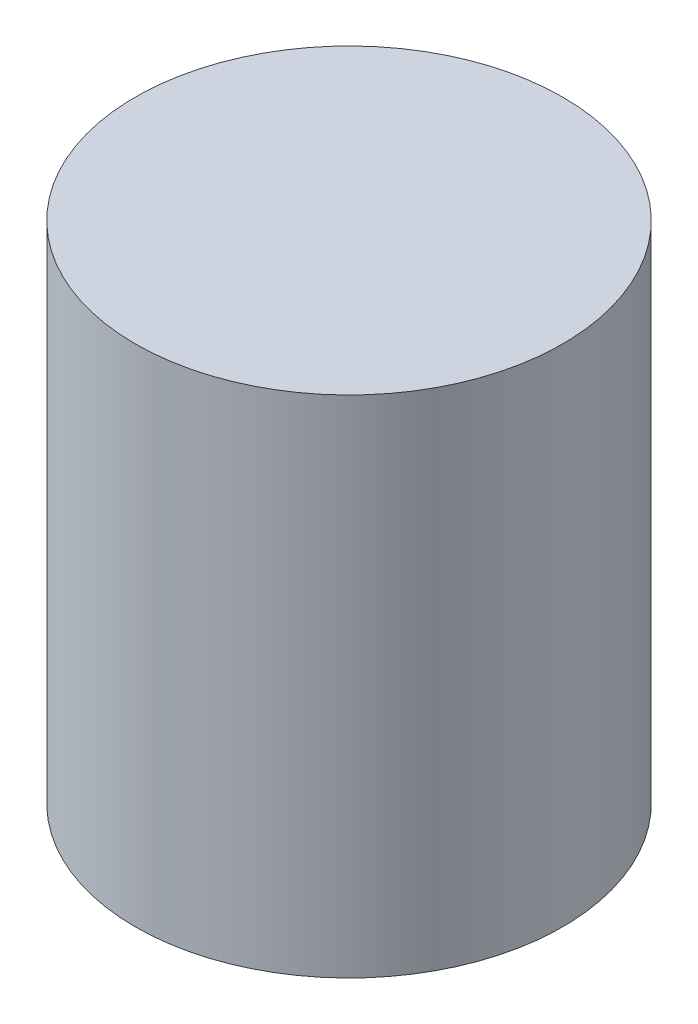
ISO-10303-21;
HEADER;
FILE_DESCRIPTION(('STEP AP214'),'2;1');
FILE_NAME('part.step','',(''),(''),'','','');
FILE_SCHEMA(('AUTOMOTIVE_DESIGN { 1 0 10303 214 1 1 1 1 }'));
ENDSEC;
DATA;
#1=APPLICATION_CONTEXT('core data for automotive mechanical design processes');
#2=APPLICATION_PROTOCOL_DEFINITION('international standard','automotive_design',2000,#1);
#3=PRODUCT_CONTEXT('',#1,'mechanical');
#4=PRODUCT('Part','Part','',(#3));
#5=PRODUCT_RELATED_PRODUCT_CATEGORY('part','',(#4));
#6=PRODUCT_DEFINITION_FORMATION('','',#4);
#7=PRODUCT_DEFINITION_CONTEXT('part definition',#1,'design');
#8=PRODUCT_DEFINITION('design','',#6,#7);
#9=PRODUCT_DEFINITION_SHAPE('','',#8);
#10=(LENGTH_UNIT() NAMED_UNIT(*) SI_UNIT(.MILLI.,.METRE.));
#11=(NAMED_UNIT(*) PLANE_ANGLE_UNIT() SI_UNIT($,.RADIAN.));
#12=(NAMED_UNIT(*) SI_UNIT($,.STERADIAN.) SOLID_ANGLE_UNIT());
#13=UNCERTAINTY_MEASURE_WITH_UNIT(LENGTH_MEASURE(1.E-05),#10,'distance_accuracy_value','');
#14=(GEOMETRIC_REPRESENTATION_CONTEXT(3) GLOBAL_UNCERTAINTY_ASSIGNED_CONTEXT((#13)) GLOBAL_UNIT_ASSIGNED_CONTEXT((#10,
#11,#12)) REPRESENTATION_CONTEXT('',''));
#15=CARTESIAN_POINT('',(0.,0.,0.));
#16=DIRECTION('',(0.,0.,1.));
#17=DIRECTION('',(1.,0.,0.));
#18=AXIS2_PLACEMENT_3D('',#15,#16,#17);
#19=CARTESIAN_POINT('',(0.,30.,0.));
#20=DIRECTION('',(0.,-1.,0.));
#21=DIRECTION('',(0.,0.,-1.));
#22=AXIS2_PLACEMENT_3D('',#19,#20,#21);
#23=CYLINDRICAL_SURFACE('',#22,12.7);
#24=CARTESIAN_POINT('',(0.,30.,0.));
#25=DIRECTION('',(0.,1.,0.));
#26=DIRECTION('',(0.,0.,1.));
#27=AXIS2_PLACEMENT_3D('',#24,#25,#26);
#28=CIRCLE('',#27,12.7);
#29=CARTESIAN_POINT('',(0.,30.,12.7));
#30=VERTEX_POINT('',#29);
#31=EDGE_CURVE('E10',#30,#30,#28,.T.);
#32=ORIENTED_EDGE('',*,*,#31,.F.);
#33=EDGE_LOOP('',(#32));
#34=FACE_BOUND('',#33,.T.);
#35=CARTESIAN_POINT('',(0.,0.,0.));
#36=DIRECTION('',(0.,1.,0.));
#37=DIRECTION('',(0.,0.,1.));
#38=AXIS2_PLACEMENT_3D('',#35,#36,#37);
#39=CIRCLE('',#38,12.7);
#40=CARTESIAN_POINT('',(0.,0.,12.7));
#41=VERTEX_POINT('',#40);
#42=EDGE_CURVE('E33',#41,#41,#39,.T.);
#43=ORIENTED_EDGE('',*,*,#42,.T.);
#44=EDGE_LOOP('',(#43));
#45=FACE_BOUND('',#44,.T.);
#46=ADVANCED_FACE('F30',(#34,#45),#23,.T.);
#47=CARTESIAN_POINT('',(0.,30.,0.));
#48=DIRECTION('',(0.,1.,0.));
#49=DIRECTION('',(0.,0.,1.));
#50=AXIS2_PLACEMENT_3D('',#47,#48,#49);
#51=PLANE('',#50);
#52=ORIENTED_EDGE('',*,*,#31,.T.);
#53=EDGE_LOOP('',(#52));
#54=FACE_BOUND('',#53,.T.);
#55=ADVANCED_FACE('F45',(#54),#51,.T.);
#56=CARTESIAN_POINT('',(0.,0.,0.));
#57=DIRECTION('',(0.,1.,0.));
#58=DIRECTION('',(0.,0.,1.));
#59=AXIS2_PLACEMENT_3D('',#56,#57,#58);
#60=PLANE('',#59);
#61=ORIENTED_EDGE('',*,*,#42,.F.);
#62=EDGE_LOOP('',(#61));
#63=FACE_BOUND('',#62,.T.);
#64=ADVANCED_FACE('F43',(#63),#60,.F.);
#65=CLOSED_SHELL('',(#46,#55,#64));
#66=MANIFOLD_SOLID_BREP('B2',#65);
#67=ADVANCED_BREP_SHAPE_REPRESENTATION('',(#18,#66),#14);
#68=SHAPE_DEFINITION_REPRESENTATION(#9,#67);
ENDSEC;
END-ISO-10303-21;
